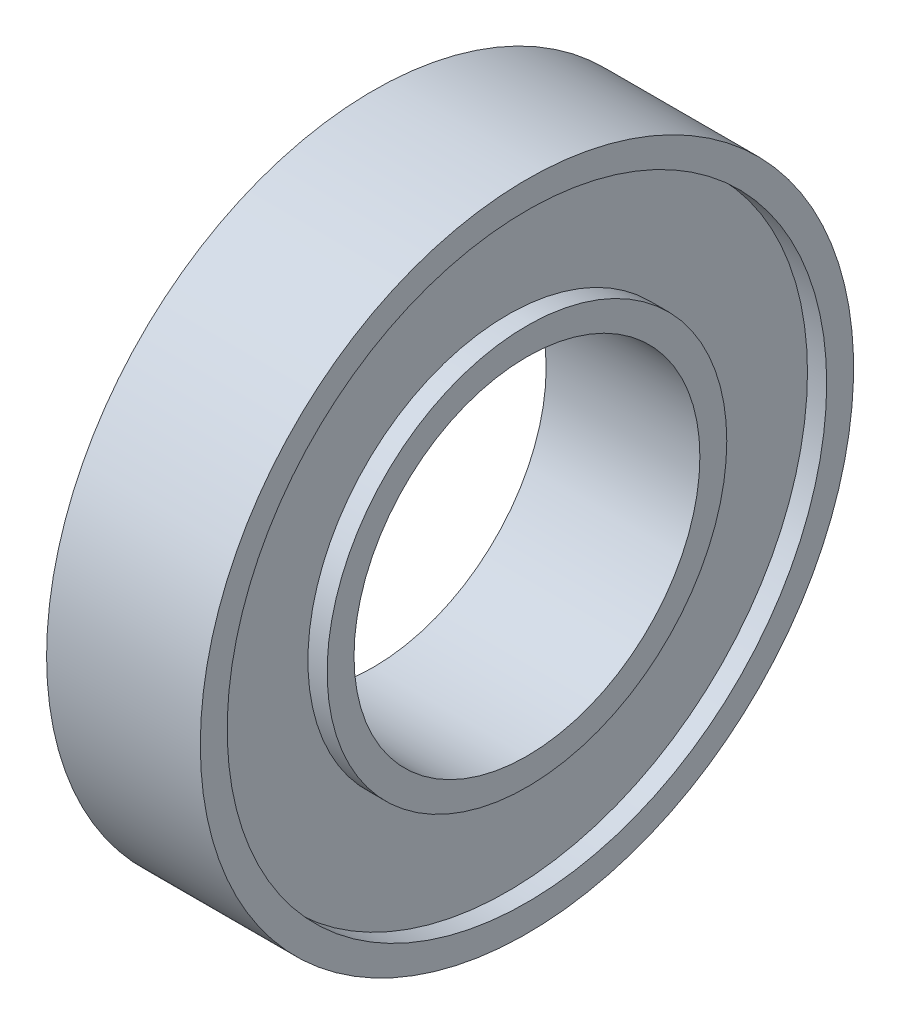
ISO-10303-21;
HEADER;
FILE_DESCRIPTION(('STEP AP214'),'2;1');
FILE_NAME('part.step','',(''),(''),'','','');
FILE_SCHEMA(('AUTOMOTIVE_DESIGN { 1 0 10303 214 1 1 1 1 }'));
ENDSEC;
DATA;
#1=APPLICATION_CONTEXT('core data for automotive mechanical design processes');
#2=APPLICATION_PROTOCOL_DEFINITION('international standard','automotive_design',2000,#1);
#3=PRODUCT_CONTEXT('',#1,'mechanical');
#4=PRODUCT('Part','Part','',(#3));
#5=PRODUCT_RELATED_PRODUCT_CATEGORY('part','',(#4));
#6=PRODUCT_DEFINITION_FORMATION('','',#4);
#7=PRODUCT_DEFINITION_CONTEXT('part definition',#1,'design');
#8=PRODUCT_DEFINITION('design','',#6,#7);
#9=PRODUCT_DEFINITION_SHAPE('','',#8);
#10=(LENGTH_UNIT() NAMED_UNIT(*) SI_UNIT(.MILLI.,.METRE.));
#11=(NAMED_UNIT(*) PLANE_ANGLE_UNIT() SI_UNIT($,.RADIAN.));
#12=(NAMED_UNIT(*) SI_UNIT($,.STERADIAN.) SOLID_ANGLE_UNIT());
#13=UNCERTAINTY_MEASURE_WITH_UNIT(LENGTH_MEASURE(1.E-05),#10,'distance_accuracy_value','');
#14=(GEOMETRIC_REPRESENTATION_CONTEXT(3) GLOBAL_UNCERTAINTY_ASSIGNED_CONTEXT((#13)) GLOBAL_UNIT_ASSIGNED_CONTEXT((#10,
#11,#12)) REPRESENTATION_CONTEXT('',''));
#15=CARTESIAN_POINT('',(0.,0.,0.));
#16=DIRECTION('',(0.,0.,1.));
#17=DIRECTION('',(1.,0.,0.));
#18=AXIS2_PLACEMENT_3D('',#15,#16,#17);
#19=CARTESIAN_POINT('',(0.,0.,0.));
#20=DIRECTION('',(-1.,0.,0.));
#21=DIRECTION('',(0.,0.,1.));
#22=AXIS2_PLACEMENT_3D('',#19,#20,#21);
#23=PLANE('',#22);
#24=CARTESIAN_POINT('',(0.,0.,0.));
#25=DIRECTION('',(-1.,0.,0.));
#26=DIRECTION('',(0.,0.,1.));
#27=AXIS2_PLACEMENT_3D('',#24,#25,#26);
#28=CIRCLE('',#27,4.5);
#29=CARTESIAN_POINT('',(0.,0.,4.5));
#30=VERTEX_POINT('',#29);
#31=EDGE_CURVE('E47',#30,#30,#28,.T.);
#32=ORIENTED_EDGE('',*,*,#31,.F.);
#33=EDGE_LOOP('',(#32));
#34=FACE_BOUND('',#33,.T.);
#35=CARTESIAN_POINT('',(0.,0.,0.));
#36=DIRECTION('',(1.,0.,0.));
#37=DIRECTION('',(0.,0.,-1.));
#38=AXIS2_PLACEMENT_3D('',#35,#36,#37);
#39=CIRCLE('',#38,5.2);
#40=CARTESIAN_POINT('',(0.,0.,-5.2));
#41=VERTEX_POINT('',#40);
#42=EDGE_CURVE('E71',#41,#41,#39,.T.);
#43=ORIENTED_EDGE('',*,*,#42,.F.);
#44=EDGE_LOOP('',(#43));
#45=FACE_BOUND('',#44,.T.);
#46=ADVANCED_FACE('F32',(#34,#45),#23,.T.);
#47=CARTESIAN_POINT('',(4.,0.,0.));
#48=DIRECTION('',(-1.,0.,0.));
#49=DIRECTION('',(0.,0.,1.));
#50=AXIS2_PLACEMENT_3D('',#47,#48,#49);
#51=PLANE('',#50);
#52=CARTESIAN_POINT('',(4.,0.,0.));
#53=DIRECTION('',(-1.,0.,0.));
#54=DIRECTION('',(0.,0.,1.));
#55=AXIS2_PLACEMENT_3D('',#52,#53,#54);
#56=CIRCLE('',#55,4.5);
#57=CARTESIAN_POINT('',(4.,0.,4.5));
#58=VERTEX_POINT('',#57);
#59=EDGE_CURVE('E10',#58,#58,#56,.T.);
#60=ORIENTED_EDGE('',*,*,#59,.T.);
#61=EDGE_LOOP('',(#60));
#62=FACE_BOUND('',#61,.T.);
#63=CARTESIAN_POINT('',(4.,0.,0.));
#64=DIRECTION('',(1.,0.,0.));
#65=DIRECTION('',(0.,0.,-1.));
#66=AXIS2_PLACEMENT_3D('',#63,#64,#65);
#67=CIRCLE('',#66,5.2);
#68=CARTESIAN_POINT('',(4.,0.,-5.2));
#69=VERTEX_POINT('',#68);
#70=EDGE_CURVE('E59',#69,#69,#67,.T.);
#71=ORIENTED_EDGE('',*,*,#70,.T.);
#72=EDGE_LOOP('',(#71));
#73=FACE_BOUND('',#72,.T.);
#74=ADVANCED_FACE('F87',(#62,#73),#51,.F.);
#75=CARTESIAN_POINT('',(0.,0.,0.));
#76=DIRECTION('',(-1.,0.,0.));
#77=DIRECTION('',(0.,0.,1.));
#78=AXIS2_PLACEMENT_3D('',#75,#76,#77);
#79=CYLINDRICAL_SURFACE('',#78,4.5);
#80=ORIENTED_EDGE('',*,*,#59,.F.);
#81=EDGE_LOOP('',(#80));
#82=FACE_BOUND('',#81,.T.);
#83=ORIENTED_EDGE('',*,*,#31,.T.);
#84=EDGE_LOOP('',(#83));
#85=FACE_BOUND('',#84,.T.);
#86=ADVANCED_FACE('F34',(#82,#85),#79,.F.);
#87=CARTESIAN_POINT('',(4.,0.,0.));
#88=DIRECTION('',(1.,0.,0.));
#89=DIRECTION('',(0.,0.,-1.));
#90=AXIS2_PLACEMENT_3D('',#87,#88,#89);
#91=CIRCLE('',#90,7.8);
#92=CARTESIAN_POINT('',(4.,0.,-7.8));
#93=VERTEX_POINT('',#92);
#94=EDGE_CURVE('E53',#93,#93,#91,.T.);
#95=ORIENTED_EDGE('',*,*,#94,.F.);
#96=EDGE_LOOP('',(#95));
#97=FACE_BOUND('',#96,.T.);
#98=CARTESIAN_POINT('',(4.,0.,0.));
#99=DIRECTION('',(-1.,0.,0.));
#100=DIRECTION('',(0.,0.,1.));
#101=AXIS2_PLACEMENT_3D('',#98,#99,#100);
#102=CIRCLE('',#101,8.5);
#103=CARTESIAN_POINT('',(4.,0.,8.5));
#104=VERTEX_POINT('',#103);
#105=EDGE_CURVE('E39',#104,#104,#102,.T.);
#106=ORIENTED_EDGE('',*,*,#105,.F.);
#107=EDGE_LOOP('',(#106));
#108=FACE_BOUND('',#107,.T.);
#109=ADVANCED_FACE('F94',(#97,#108),#51,.F.);
#110=CARTESIAN_POINT('',(0.,0.,0.));
#111=DIRECTION('',(-1.,0.,0.));
#112=DIRECTION('',(0.,0.,1.));
#113=AXIS2_PLACEMENT_3D('',#110,#111,#112);
#114=CYLINDRICAL_SURFACE('',#113,8.5);
#115=ORIENTED_EDGE('',*,*,#105,.T.);
#116=EDGE_LOOP('',(#115));
#117=FACE_BOUND('',#116,.T.);
#118=CARTESIAN_POINT('',(0.,0.,0.));
#119=DIRECTION('',(-1.,0.,0.));
#120=DIRECTION('',(0.,0.,1.));
#121=AXIS2_PLACEMENT_3D('',#118,#119,#120);
#122=CIRCLE('',#121,8.5);
#123=CARTESIAN_POINT('',(0.,0.,8.5));
#124=VERTEX_POINT('',#123);
#125=EDGE_CURVE('E43',#124,#124,#122,.T.);
#126=ORIENTED_EDGE('',*,*,#125,.F.);
#127=EDGE_LOOP('',(#126));
#128=FACE_BOUND('',#127,.T.);
#129=ADVANCED_FACE('F100',(#117,#128),#114,.T.);
#130=CARTESIAN_POINT('',(0.,0.,0.));
#131=DIRECTION('',(1.,0.,0.));
#132=DIRECTION('',(0.,0.,-1.));
#133=AXIS2_PLACEMENT_3D('',#130,#131,#132);
#134=CIRCLE('',#133,7.8);
#135=CARTESIAN_POINT('',(0.,0.,-7.8));
#136=VERTEX_POINT('',#135);
#137=EDGE_CURVE('E65',#136,#136,#134,.T.);
#138=ORIENTED_EDGE('',*,*,#137,.T.);
#139=EDGE_LOOP('',(#138));
#140=FACE_BOUND('',#139,.T.);
#141=ORIENTED_EDGE('',*,*,#125,.T.);
#142=EDGE_LOOP('',(#141));
#143=FACE_BOUND('',#142,.T.);
#144=ADVANCED_FACE('F90',(#140,#143),#23,.T.);
#145=CARTESIAN_POINT('',(3.5,0.,0.));
#146=DIRECTION('',(1.,0.,0.));
#147=DIRECTION('',(0.,0.,-1.));
#148=AXIS2_PLACEMENT_3D('',#145,#146,#147);
#149=CYLINDRICAL_SURFACE('',#148,7.8);
#150=CARTESIAN_POINT('',(3.5,0.,0.));
#151=DIRECTION('',(1.,0.,0.));
#152=DIRECTION('',(0.,0.,-1.));
#153=AXIS2_PLACEMENT_3D('',#150,#151,#152);
#154=CIRCLE('',#153,7.8);
#155=CARTESIAN_POINT('',(3.5,0.,-7.8));
#156=VERTEX_POINT('',#155);
#157=EDGE_CURVE('E52',#156,#156,#154,.T.);
#158=ORIENTED_EDGE('',*,*,#157,.F.);
#159=EDGE_LOOP('',(#158));
#160=FACE_BOUND('',#159,.T.);
#161=ORIENTED_EDGE('',*,*,#94,.T.);
#162=EDGE_LOOP('',(#161));
#163=FACE_BOUND('',#162,.T.);
#164=ADVANCED_FACE('F99',(#160,#163),#149,.F.);
#165=CARTESIAN_POINT('',(3.5,0.,0.));
#166=DIRECTION('',(1.,0.,0.));
#167=DIRECTION('',(0.,0.,-1.));
#168=AXIS2_PLACEMENT_3D('',#165,#166,#167);
#169=PLANE('',#168);
#170=CARTESIAN_POINT('',(3.5,0.,0.));
#171=DIRECTION('',(1.,0.,0.));
#172=DIRECTION('',(0.,0.,-1.));
#173=AXIS2_PLACEMENT_3D('',#170,#171,#172);
#174=CIRCLE('',#173,5.2);
#175=CARTESIAN_POINT('',(3.5,0.,-5.2));
#176=VERTEX_POINT('',#175);
#177=EDGE_CURVE('E56',#176,#176,#174,.T.);
#178=ORIENTED_EDGE('',*,*,#177,.F.);
#179=EDGE_LOOP('',(#178));
#180=FACE_BOUND('',#179,.T.);
#181=ORIENTED_EDGE('',*,*,#157,.T.);
#182=EDGE_LOOP('',(#181));
#183=FACE_BOUND('',#182,.T.);
#184=ADVANCED_FACE('F106',(#180,#183),#169,.T.);
#185=CARTESIAN_POINT('',(3.5,0.,0.));
#186=DIRECTION('',(1.,0.,0.));
#187=DIRECTION('',(0.,0.,-1.));
#188=AXIS2_PLACEMENT_3D('',#185,#186,#187);
#189=CYLINDRICAL_SURFACE('',#188,5.2);
#190=ORIENTED_EDGE('',*,*,#177,.T.);
#191=EDGE_LOOP('',(#190));
#192=FACE_BOUND('',#191,.T.);
#193=ORIENTED_EDGE('',*,*,#70,.F.);
#194=EDGE_LOOP('',(#193));
#195=FACE_BOUND('',#194,.T.);
#196=ADVANCED_FACE('F119',(#192,#195),#189,.T.);
#197=CARTESIAN_POINT('',(0.5,0.,0.));
#198=DIRECTION('',(-1.,0.,0.));
#199=DIRECTION('',(0.,0.,-1.));
#200=AXIS2_PLACEMENT_3D('',#197,#198,#199);
#201=PLANE('',#200);
#202=CARTESIAN_POINT('',(0.5,0.,0.));
#203=DIRECTION('',(1.,0.,0.));
#204=DIRECTION('',(0.,0.,-1.));
#205=AXIS2_PLACEMENT_3D('',#202,#203,#204);
#206=CIRCLE('',#205,7.8);
#207=CARTESIAN_POINT('',(0.5,0.,-7.8));
#208=VERTEX_POINT('',#207);
#209=EDGE_CURVE('E62',#208,#208,#206,.T.);
#210=ORIENTED_EDGE('',*,*,#209,.F.);
#211=EDGE_LOOP('',(#210));
#212=FACE_BOUND('',#211,.T.);
#213=CARTESIAN_POINT('',(0.5,0.,0.));
#214=DIRECTION('',(1.,0.,0.));
#215=DIRECTION('',(0.,0.,-1.));
#216=AXIS2_PLACEMENT_3D('',#213,#214,#215);
#217=CIRCLE('',#216,5.2);
#218=CARTESIAN_POINT('',(0.5,0.,-5.2));
#219=VERTEX_POINT('',#218);
#220=EDGE_CURVE('E68',#219,#219,#217,.T.);
#221=ORIENTED_EDGE('',*,*,#220,.T.);
#222=EDGE_LOOP('',(#221));
#223=FACE_BOUND('',#222,.T.);
#224=ADVANCED_FACE('F77',(#212,#223),#201,.T.);
#225=CARTESIAN_POINT('',(0.5,0.,0.));
#226=DIRECTION('',(-1.,0.,0.));
#227=DIRECTION('',(0.,0.,1.));
#228=AXIS2_PLACEMENT_3D('',#225,#226,#227);
#229=CYLINDRICAL_SURFACE('',#228,7.8);
#230=ORIENTED_EDGE('',*,*,#209,.T.);
#231=EDGE_LOOP('',(#230));
#232=FACE_BOUND('',#231,.T.);
#233=ORIENTED_EDGE('',*,*,#137,.F.);
#234=EDGE_LOOP('',(#233));
#235=FACE_BOUND('',#234,.T.);
#236=ADVANCED_FACE('F82',(#232,#235),#229,.F.);
#237=CARTESIAN_POINT('',(0.5,0.,0.));
#238=DIRECTION('',(-1.,0.,0.));
#239=DIRECTION('',(0.,0.,1.));
#240=AXIS2_PLACEMENT_3D('',#237,#238,#239);
#241=CYLINDRICAL_SURFACE('',#240,5.2);
#242=ORIENTED_EDGE('',*,*,#220,.F.);
#243=EDGE_LOOP('',(#242));
#244=FACE_BOUND('',#243,.T.);
#245=ORIENTED_EDGE('',*,*,#42,.T.);
#246=EDGE_LOOP('',(#245));
#247=FACE_BOUND('',#246,.T.);
#248=ADVANCED_FACE('F79',(#244,#247),#241,.T.);
#249=CLOSED_SHELL('',(#46,#74,#86,#109,#129,#144,#164,#184,#196,#224,#236,#248));
#250=MANIFOLD_SOLID_BREP('B2',#249);
#251=ADVANCED_BREP_SHAPE_REPRESENTATION('',(#18,#250),#14);
#252=SHAPE_DEFINITION_REPRESENTATION(#9,#251);
ENDSEC;
END-ISO-10303-21;
